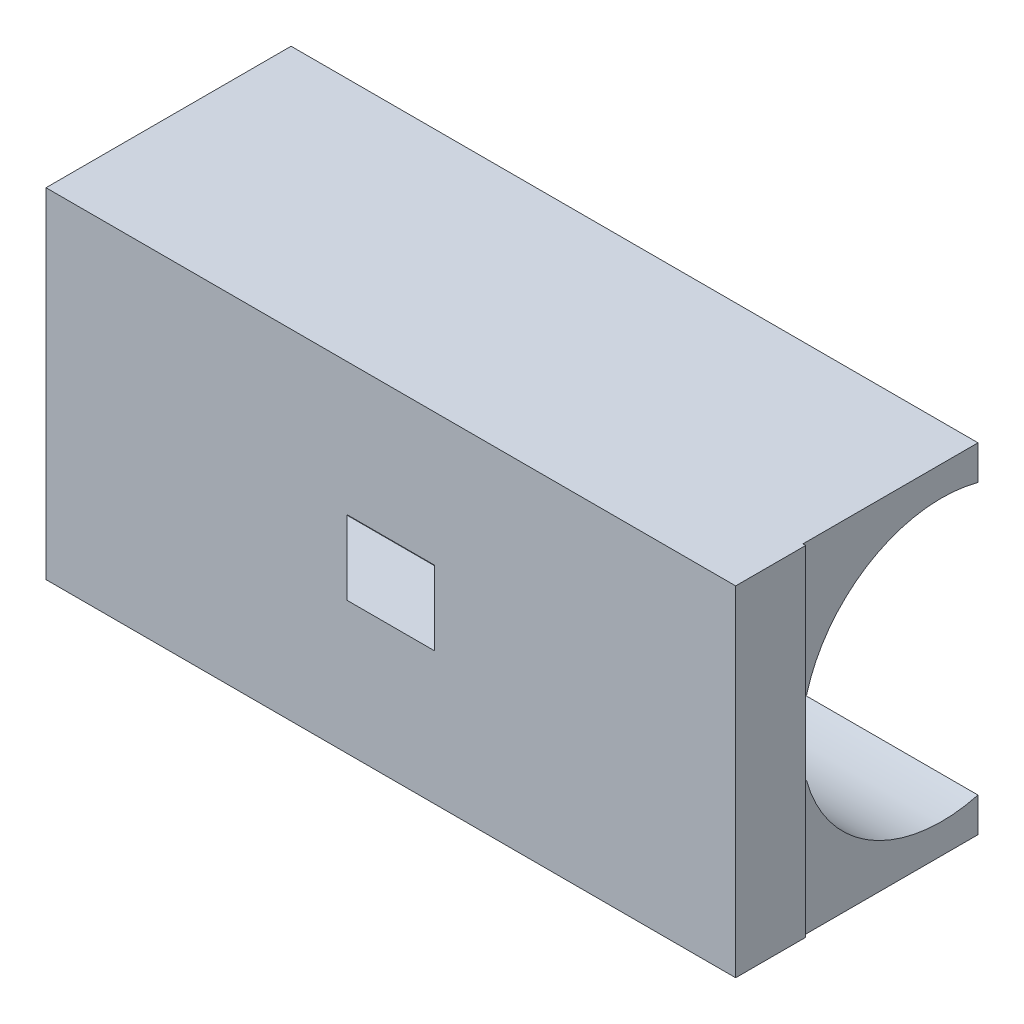
ISO-10303-21;
HEADER;
FILE_DESCRIPTION(('STEP AP214'),'2;1');
FILE_NAME('part.step','',(''),(''),'','','');
FILE_SCHEMA(('AUTOMOTIVE_DESIGN { 1 0 10303 214 1 1 1 1 }'));
ENDSEC;
DATA;
#1=APPLICATION_CONTEXT('core data for automotive mechanical design processes');
#2=APPLICATION_PROTOCOL_DEFINITION('international standard','automotive_design',2000,#1);
#3=PRODUCT_CONTEXT('',#1,'mechanical');
#4=PRODUCT('Part','Part','',(#3));
#5=PRODUCT_RELATED_PRODUCT_CATEGORY('part','',(#4));
#6=PRODUCT_DEFINITION_FORMATION('','',#4);
#7=PRODUCT_DEFINITION_CONTEXT('part definition',#1,'design');
#8=PRODUCT_DEFINITION('design','',#6,#7);
#9=PRODUCT_DEFINITION_SHAPE('','',#8);
#10=(LENGTH_UNIT() NAMED_UNIT(*) SI_UNIT(.MILLI.,.METRE.));
#11=(NAMED_UNIT(*) PLANE_ANGLE_UNIT() SI_UNIT($,.RADIAN.));
#12=(NAMED_UNIT(*) SI_UNIT($,.STERADIAN.) SOLID_ANGLE_UNIT());
#13=UNCERTAINTY_MEASURE_WITH_UNIT(LENGTH_MEASURE(1.E-05),#10,'distance_accuracy_value','');
#14=(GEOMETRIC_REPRESENTATION_CONTEXT(3) GLOBAL_UNCERTAINTY_ASSIGNED_CONTEXT((#13)) GLOBAL_UNIT_ASSIGNED_CONTEXT((#10,
#11,#12)) REPRESENTATION_CONTEXT('',''));
#15=CARTESIAN_POINT('',(0.,0.,0.));
#16=DIRECTION('',(0.,0.,1.));
#17=DIRECTION('',(1.,0.,0.));
#18=AXIS2_PLACEMENT_3D('',#15,#16,#17);
#19=CARTESIAN_POINT('',(24.9,-2.7,0.));
#20=DIRECTION('',(0.,-1.,0.));
#21=DIRECTION('',(0.,0.,-1.));
#22=AXIS2_PLACEMENT_3D('',#19,#20,#21);
#23=PLANE('',#22);
#24=DIRECTION('',(-0.707106781186546,0.,0.707106781186549));
#25=VECTOR('',#24,1.);
#26=CARTESIAN_POINT('',(21.6414213562373,-2.7,-3.25857864376272));
#27=LINE('',#26,#25);
#28=CARTESIAN_POINT('',(8.28284271247459,-2.7,10.1));
#29=VERTEX_POINT('',#28);
#30=CARTESIAN_POINT('',(3.18284271247461,-2.7,15.2));
#31=VERTEX_POINT('',#30);
#32=EDGE_CURVE('E189',#29,#31,#27,.T.);
#33=ORIENTED_EDGE('',*,*,#32,.F.);
#34=DIRECTION('',(-1.,0.,0.));
#35=VECTOR('',#34,1.);
#36=CARTESIAN_POINT('',(24.9,-2.7,10.1));
#37=LINE('',#36,#35);
#38=CARTESIAN_POINT('',(24.9,-2.7,10.1));
#39=VERTEX_POINT('',#38);
#40=EDGE_CURVE('E187',#39,#29,#37,.T.);
#41=ORIENTED_EDGE('',*,*,#40,.F.);
#42=DIRECTION('',(0.,0.,1.));
#43=VECTOR('',#42,1.);
#44=CARTESIAN_POINT('',(24.9,-2.7,0.));
#45=LINE('',#44,#43);
#46=CARTESIAN_POINT('',(24.9,-2.7,9.83615778645326));
#47=VERTEX_POINT('',#46);
#48=EDGE_CURVE('E241',#47,#39,#45,.T.);
#49=ORIENTED_EDGE('',*,*,#48,.F.);
#50=DIRECTION('',(-1.,0.,0.));
#51=VECTOR('',#50,1.);
#52=CARTESIAN_POINT('',(24.9,-2.7,9.83615778645326));
#53=LINE('',#52,#51);
#54=CARTESIAN_POINT('',(-25.1,-2.7,9.83615778645326));
#55=VERTEX_POINT('',#54);
#56=EDGE_CURVE('E264',#47,#55,#53,.T.);
#57=ORIENTED_EDGE('',*,*,#56,.T.);
#58=DIRECTION('',(0.,0.,1.));
#59=VECTOR('',#58,1.);
#60=CARTESIAN_POINT('',(-25.1,-2.7,0.));
#61=LINE('',#60,#59);
#62=CARTESIAN_POINT('',(-25.1,-2.7,10.1));
#63=VERTEX_POINT('',#62);
#64=EDGE_CURVE('E253',#55,#63,#61,.T.);
#65=ORIENTED_EDGE('',*,*,#64,.T.);
#66=DIRECTION('',(-1.,0.,0.));
#67=VECTOR('',#66,1.);
#68=CARTESIAN_POINT('',(24.9,-2.7,10.1));
#69=LINE('',#68,#67);
#70=CARTESIAN_POINT('',(-8.28284271247459,-2.7,10.1));
#71=VERTEX_POINT('',#70);
#72=EDGE_CURVE('E231',#71,#63,#69,.T.);
#73=ORIENTED_EDGE('',*,*,#72,.F.);
#74=DIRECTION('',(-0.707106781186546,0.,-0.707106781186549));
#75=VECTOR('',#74,1.);
#76=CARTESIAN_POINT('',(3.25857864376264,-2.7,21.6414213562373));
#77=LINE('',#76,#75);
#78=CARTESIAN_POINT('',(-3.1828427124746,-2.7,15.2));
#79=VERTEX_POINT('',#78);
#80=EDGE_CURVE('E234',#79,#71,#77,.T.);
#81=ORIENTED_EDGE('',*,*,#80,.F.);
#82=DIRECTION('',(-1.,0.,0.));
#83=VECTOR('',#82,1.);
#84=CARTESIAN_POINT('',(24.9,-2.7,15.2));
#85=LINE('',#84,#83);
#86=EDGE_CURVE('E154',#31,#79,#85,.T.);
#87=ORIENTED_EDGE('',*,*,#86,.F.);
#88=EDGE_LOOP('',(#33,#41,#49,#57,#65,#73,#81,#87));
#89=FACE_BOUND('',#88,.T.);
#90=ADVANCED_FACE('F33',(#89),#23,.F.);
#91=CARTESIAN_POINT('',(24.9,0.,0.));
#92=DIRECTION('',(1.,0.,0.));
#93=DIRECTION('',(0.,0.,-1.));
#94=AXIS2_PLACEMENT_3D('',#91,#92,#93);
#95=PLANE('',#94);
#96=ORIENTED_EDGE('',*,*,#48,.T.);
#97=DIRECTION('',(0.,-1.,0.));
#98=VECTOR('',#97,1.);
#99=CARTESIAN_POINT('',(24.9,0.,10.1));
#100=LINE('',#99,#98);
#101=CARTESIAN_POINT('',(24.9,-12.3524434281487,10.1));
#102=VERTEX_POINT('',#101);
#103=EDGE_CURVE('E184',#39,#102,#100,.T.);
#104=ORIENTED_EDGE('',*,*,#103,.T.);
#105=DIRECTION('',(0.,0.,1.));
#106=VECTOR('',#105,1.);
#107=CARTESIAN_POINT('',(24.9,-12.3524434281487,0.));
#108=LINE('',#107,#106);
#109=CARTESIAN_POINT('',(24.9,-12.3524434281487,-2.63995426004582));
#110=VERTEX_POINT('',#109);
#111=EDGE_CURVE('E245',#110,#102,#108,.T.);
#112=ORIENTED_EDGE('',*,*,#111,.F.);
#113=DIRECTION('',(0.,-1.,0.));
#114=VECTOR('',#113,1.);
#115=CARTESIAN_POINT('',(24.9,0.,-2.63995426004581));
#116=LINE('',#115,#114);
#117=CARTESIAN_POINT('',(24.9,-9.85244342814873,-2.63995426004581));
#118=VERTEX_POINT('',#117);
#119=EDGE_CURVE('E247',#118,#110,#116,.T.);
#120=ORIENTED_EDGE('',*,*,#119,.F.);
#121=CARTESIAN_POINT('',(24.9,0.,0.));
#122=DIRECTION('',(1.,0.,0.));
#123=DIRECTION('',(0.,0.,-1.));
#124=AXIS2_PLACEMENT_3D('',#121,#122,#123);
#125=CIRCLE('',#124,10.2000000000002);
#126=EDGE_CURVE('E238',#47,#118,#125,.T.);
#127=ORIENTED_EDGE('',*,*,#126,.F.);
#128=EDGE_LOOP('',(#96,#104,#112,#120,#127));
#129=FACE_BOUND('',#128,.T.);
#130=ADVANCED_FACE('F331',(#129),#95,.T.);
#131=CARTESIAN_POINT('',(24.9,2.7,0.));
#132=DIRECTION('',(0.,-1.,0.));
#133=DIRECTION('',(0.,0.,-1.));
#134=AXIS2_PLACEMENT_3D('',#131,#132,#133);
#135=PLANE('',#134);
#136=DIRECTION('',(-1.,0.,0.));
#137=VECTOR('',#136,1.);
#138=CARTESIAN_POINT('',(24.9,2.7,10.1));
#139=LINE('',#138,#137);
#140=CARTESIAN_POINT('',(24.9,2.7,10.1));
#141=VERTEX_POINT('',#140);
#142=CARTESIAN_POINT('',(8.28284271247459,2.7,10.1));
#143=VERTEX_POINT('',#142);
#144=EDGE_CURVE('E47',#141,#143,#139,.T.);
#145=ORIENTED_EDGE('',*,*,#144,.T.);
#146=DIRECTION('',(-0.707106781186546,0.,0.707106781186549));
#147=VECTOR('',#146,1.);
#148=CARTESIAN_POINT('',(21.6414213562373,2.7,-3.25857864376272));
#149=LINE('',#148,#147);
#150=CARTESIAN_POINT('',(3.18284271247461,2.7,15.2));
#151=VERTEX_POINT('',#150);
#152=EDGE_CURVE('E11',#143,#151,#149,.T.);
#153=ORIENTED_EDGE('',*,*,#152,.T.);
#154=DIRECTION('',(-1.,0.,0.));
#155=VECTOR('',#154,1.);
#156=CARTESIAN_POINT('',(24.9,2.7,15.2));
#157=LINE('',#156,#155);
#158=CARTESIAN_POINT('',(-3.18284271247461,2.7,15.2));
#159=VERTEX_POINT('',#158);
#160=EDGE_CURVE('E201',#151,#159,#157,.T.);
#161=ORIENTED_EDGE('',*,*,#160,.T.);
#162=DIRECTION('',(0.707106781186546,0.,0.707106781186549));
#163=VECTOR('',#162,1.);
#164=CARTESIAN_POINT('',(-3.18284271247461,2.7,15.2));
#165=LINE('',#164,#163);
#166=CARTESIAN_POINT('',(-8.28284271247459,2.7,10.1));
#167=VERTEX_POINT('',#166);
#168=EDGE_CURVE('E216',#167,#159,#165,.T.);
#169=ORIENTED_EDGE('',*,*,#168,.F.);
#170=DIRECTION('',(1.,0.,0.));
#171=VECTOR('',#170,1.);
#172=CARTESIAN_POINT('',(-25.1,2.7,10.1));
#173=LINE('',#172,#171);
#174=CARTESIAN_POINT('',(-25.1,2.7,10.1));
#175=VERTEX_POINT('',#174);
#176=EDGE_CURVE('E266',#175,#167,#173,.T.);
#177=ORIENTED_EDGE('',*,*,#176,.F.);
#178=DIRECTION('',(0.,0.,1.));
#179=VECTOR('',#178,1.);
#180=CARTESIAN_POINT('',(-25.1,2.7,0.));
#181=LINE('',#180,#179);
#182=CARTESIAN_POINT('',(-25.1,2.7,9.83615778645326));
#183=VERTEX_POINT('',#182);
#184=EDGE_CURVE('E191',#183,#175,#181,.T.);
#185=ORIENTED_EDGE('',*,*,#184,.F.);
#186=DIRECTION('',(-1.,0.,0.));
#187=VECTOR('',#186,1.);
#188=CARTESIAN_POINT('',(24.9,2.7,9.83615778645326));
#189=LINE('',#188,#187);
#190=CARTESIAN_POINT('',(24.9,2.7,9.83615778645326));
#191=VERTEX_POINT('',#190);
#192=EDGE_CURVE('E214',#191,#183,#189,.T.);
#193=ORIENTED_EDGE('',*,*,#192,.F.);
#194=DIRECTION('',(0.,0.,1.));
#195=VECTOR('',#194,1.);
#196=CARTESIAN_POINT('',(24.9,2.7,0.));
#197=LINE('',#196,#195);
#198=EDGE_CURVE('E192',#191,#141,#197,.T.);
#199=ORIENTED_EDGE('',*,*,#198,.T.);
#200=EDGE_LOOP('',(#145,#153,#161,#169,#177,#185,#193,#199));
#201=FACE_BOUND('',#200,.T.);
#202=ADVANCED_FACE('F275',(#201),#135,.T.);
#203=CARTESIAN_POINT('',(24.9,0.,0.));
#204=DIRECTION('',(1.,0.,0.));
#205=DIRECTION('',(0.,0.,-1.));
#206=AXIS2_PLACEMENT_3D('',#203,#204,#205);
#207=PLANE('',#206);
#208=DIRECTION('',(0.,0.,1.));
#209=VECTOR('',#208,1.);
#210=CARTESIAN_POINT('',(24.9,12.3524434281487,0.));
#211=LINE('',#210,#209);
#212=CARTESIAN_POINT('',(24.9,12.3524434281487,-2.63995426004582));
#213=VERTEX_POINT('',#212);
#214=CARTESIAN_POINT('',(24.9,12.3524434281487,10.1));
#215=VERTEX_POINT('',#214);
#216=EDGE_CURVE('E199',#213,#215,#211,.T.);
#217=ORIENTED_EDGE('',*,*,#216,.T.);
#218=DIRECTION('',(0.,-1.,0.));
#219=VECTOR('',#218,1.);
#220=CARTESIAN_POINT('',(24.9,0.,10.1));
#221=LINE('',#220,#219);
#222=EDGE_CURVE('E41',#215,#141,#221,.T.);
#223=ORIENTED_EDGE('',*,*,#222,.T.);
#224=ORIENTED_EDGE('',*,*,#198,.F.);
#225=CARTESIAN_POINT('',(24.9,0.,0.));
#226=DIRECTION('',(1.,0.,0.));
#227=DIRECTION('',(0.,0.,-1.));
#228=AXIS2_PLACEMENT_3D('',#225,#226,#227);
#229=CIRCLE('',#228,10.2000000000002);
#230=CARTESIAN_POINT('',(24.9,9.85244342814873,-2.63995426004581));
#231=VERTEX_POINT('',#230);
#232=EDGE_CURVE('E194',#191,#231,#229,.F.);
#233=ORIENTED_EDGE('',*,*,#232,.T.);
#234=DIRECTION('',(0.,1.,0.));
#235=VECTOR('',#234,1.);
#236=CARTESIAN_POINT('',(24.9,0.,-2.63995426004581));
#237=LINE('',#236,#235);
#238=EDGE_CURVE('E197',#231,#213,#237,.T.);
#239=ORIENTED_EDGE('',*,*,#238,.T.);
#240=EDGE_LOOP('',(#217,#223,#224,#233,#239));
#241=FACE_BOUND('',#240,.T.);
#242=ADVANCED_FACE('F271',(#241),#207,.T.);
#243=CARTESIAN_POINT('',(24.9,0.,0.));
#244=DIRECTION('',(-1.,0.,0.));
#245=DIRECTION('',(0.,0.,1.));
#246=AXIS2_PLACEMENT_3D('',#243,#244,#245);
#247=CYLINDRICAL_SURFACE('',#246,10.2000000000002);
#248=CARTESIAN_POINT('',(-25.1,0.,0.));
#249=DIRECTION('',(1.,0.,0.));
#250=DIRECTION('',(0.,0.,-1.));
#251=AXIS2_PLACEMENT_3D('',#248,#249,#250);
#252=CIRCLE('',#251,10.2000000000002);
#253=CARTESIAN_POINT('',(-25.1,-9.85244342814873,-2.63995426004582));
#254=VERTEX_POINT('',#253);
#255=EDGE_CURVE('E237',#55,#254,#252,.T.);
#256=ORIENTED_EDGE('',*,*,#255,.F.);
#257=ORIENTED_EDGE('',*,*,#56,.F.);
#258=ORIENTED_EDGE('',*,*,#126,.T.);
#259=DIRECTION('',(-1.,0.,0.));
#260=VECTOR('',#259,1.);
#261=CARTESIAN_POINT('',(24.9,-9.85244342814873,-2.63995426004581));
#262=LINE('',#261,#260);
#263=EDGE_CURVE('E250',#118,#254,#262,.T.);
#264=ORIENTED_EDGE('',*,*,#263,.T.);
#265=EDGE_LOOP('',(#256,#257,#258,#264));
#266=FACE_BOUND('',#265,.T.);
#267=ADVANCED_FACE('F35',(#266),#247,.F.);
#268=CARTESIAN_POINT('',(24.9,0.,15.2));
#269=DIRECTION('',(0.,0.,1.));
#270=DIRECTION('',(0.,-1.,0.));
#271=AXIS2_PLACEMENT_3D('',#268,#269,#270);
#272=PLANE('',#271);
#273=DIRECTION('',(0.,-1.,0.));
#274=VECTOR('',#273,1.);
#275=CARTESIAN_POINT('',(3.18284271247461,12.3524434281487,15.2));
#276=LINE('',#275,#274);
#277=EDGE_CURVE('E164',#151,#31,#276,.T.);
#278=ORIENTED_EDGE('',*,*,#277,.T.);
#279=ORIENTED_EDGE('',*,*,#86,.T.);
#280=DIRECTION('',(0.,-1.,0.));
#281=VECTOR('',#280,1.);
#282=CARTESIAN_POINT('',(-3.18284271247461,12.3524434281487,15.2));
#283=LINE('',#282,#281);
#284=EDGE_CURVE('E228',#159,#79,#283,.T.);
#285=ORIENTED_EDGE('',*,*,#284,.F.);
#286=ORIENTED_EDGE('',*,*,#160,.F.);
#287=EDGE_LOOP('',(#278,#279,#285,#286));
#288=FACE_BOUND('',#287,.T.);
#289=DIRECTION('',(0.,-1.,0.));
#290=VECTOR('',#289,1.);
#291=CARTESIAN_POINT('',(25.1,12.3524434281487,15.2));
#292=LINE('',#291,#290);
#293=CARTESIAN_POINT('',(25.1,12.3524434281487,15.2));
#294=VERTEX_POINT('',#293);
#295=CARTESIAN_POINT('',(25.1,-12.3524434281487,15.2));
#296=VERTEX_POINT('',#295);
#297=EDGE_CURVE('E147',#294,#296,#292,.T.);
#298=ORIENTED_EDGE('',*,*,#297,.F.);
#299=DIRECTION('',(1.,0.,0.));
#300=VECTOR('',#299,1.);
#301=CARTESIAN_POINT('',(-25.1,12.3524434281487,15.2));
#302=LINE('',#301,#300);
#303=CARTESIAN_POINT('',(-25.1,12.3524434281487,15.2));
#304=VERTEX_POINT('',#303);
#305=EDGE_CURVE('E222',#304,#294,#302,.T.);
#306=ORIENTED_EDGE('',*,*,#305,.F.);
#307=DIRECTION('',(0.,1.,0.));
#308=VECTOR('',#307,1.);
#309=CARTESIAN_POINT('',(-25.1,0.,15.2));
#310=LINE('',#309,#308);
#311=CARTESIAN_POINT('',(-25.1,-12.3524434281487,15.2));
#312=VERTEX_POINT('',#311);
#313=EDGE_CURVE('E149',#312,#304,#310,.T.);
#314=ORIENTED_EDGE('',*,*,#313,.F.);
#315=DIRECTION('',(-1.,0.,0.));
#316=VECTOR('',#315,1.);
#317=CARTESIAN_POINT('',(24.9,-12.3524434281487,15.2));
#318=LINE('',#317,#316);
#319=EDGE_CURVE('E143',#296,#312,#318,.T.);
#320=ORIENTED_EDGE('',*,*,#319,.F.);
#321=EDGE_LOOP('',(#298,#306,#314,#320));
#322=FACE_BOUND('',#321,.T.);
#323=ADVANCED_FACE('F145',(#288,#322),#272,.T.);
#324=CARTESIAN_POINT('',(24.9,-12.3524434281487,0.));
#325=DIRECTION('',(0.,-1.,0.));
#326=DIRECTION('',(0.,0.,-1.));
#327=AXIS2_PLACEMENT_3D('',#324,#325,#326);
#328=PLANE('',#327);
#329=ORIENTED_EDGE('',*,*,#319,.T.);
#330=DIRECTION('',(0.,0.,1.));
#331=VECTOR('',#330,1.);
#332=CARTESIAN_POINT('',(-25.1,-12.3524434281487,0.));
#333=LINE('',#332,#331);
#334=CARTESIAN_POINT('',(-25.1,-12.3524434281487,-2.63995426004582));
#335=VERTEX_POINT('',#334);
#336=EDGE_CURVE('E257',#335,#312,#333,.T.);
#337=ORIENTED_EDGE('',*,*,#336,.F.);
#338=DIRECTION('',(-1.,0.,0.));
#339=VECTOR('',#338,1.);
#340=CARTESIAN_POINT('',(24.9,-12.3524434281487,-2.63995426004582));
#341=LINE('',#340,#339);
#342=EDGE_CURVE('E155',#110,#335,#341,.T.);
#343=ORIENTED_EDGE('',*,*,#342,.F.);
#344=ORIENTED_EDGE('',*,*,#111,.T.);
#345=DIRECTION('',(-1.,0.,0.));
#346=VECTOR('',#345,1.);
#347=CARTESIAN_POINT('',(8.28284271247459,-12.3524434281487,10.1));
#348=LINE('',#347,#346);
#349=CARTESIAN_POINT('',(25.1,-12.3524434281487,10.1));
#350=VERTEX_POINT('',#349);
#351=EDGE_CURVE('E169',#350,#102,#348,.T.);
#352=ORIENTED_EDGE('',*,*,#351,.F.);
#353=DIRECTION('',(0.,0.,-1.));
#354=VECTOR('',#353,1.);
#355=CARTESIAN_POINT('',(25.1,-12.3524434281487,10.1));
#356=LINE('',#355,#354);
#357=EDGE_CURVE('E161',#296,#350,#356,.T.);
#358=ORIENTED_EDGE('',*,*,#357,.F.);
#359=EDGE_LOOP('',(#329,#337,#343,#344,#352,#358));
#360=FACE_BOUND('',#359,.T.);
#361=ADVANCED_FACE('F167',(#360),#328,.T.);
#362=CARTESIAN_POINT('',(24.9,0.,-2.63995426004581));
#363=DIRECTION('',(0.,0.,-1.));
#364=DIRECTION('',(0.,1.,0.));
#365=AXIS2_PLACEMENT_3D('',#362,#363,#364);
#366=PLANE('',#365);
#367=DIRECTION('',(0.,-1.,0.));
#368=VECTOR('',#367,1.);
#369=CARTESIAN_POINT('',(-25.1,0.,-2.63995426004581));
#370=LINE('',#369,#368);
#371=EDGE_CURVE('E242',#254,#335,#370,.T.);
#372=ORIENTED_EDGE('',*,*,#371,.F.);
#373=ORIENTED_EDGE('',*,*,#263,.F.);
#374=ORIENTED_EDGE('',*,*,#119,.T.);
#375=ORIENTED_EDGE('',*,*,#342,.T.);
#376=EDGE_LOOP('',(#372,#373,#374,#375));
#377=FACE_BOUND('',#376,.T.);
#378=ADVANCED_FACE('F309',(#377),#366,.T.);
#379=CARTESIAN_POINT('',(-25.1,0.,0.));
#380=DIRECTION('',(1.,0.,0.));
#381=DIRECTION('',(0.,0.,-1.));
#382=AXIS2_PLACEMENT_3D('',#379,#380,#381);
#383=PLANE('',#382);
#384=ORIENTED_EDGE('',*,*,#313,.T.);
#385=DIRECTION('',(0.,0.,1.));
#386=VECTOR('',#385,1.);
#387=CARTESIAN_POINT('',(-25.1,12.3524434281487,10.1));
#388=LINE('',#387,#386);
#389=CARTESIAN_POINT('',(-25.1,12.3524434281487,-2.63995426004582));
#390=VERTEX_POINT('',#389);
#391=EDGE_CURVE('E219',#390,#304,#388,.T.);
#392=ORIENTED_EDGE('',*,*,#391,.F.);
#393=DIRECTION('',(0.,1.,0.));
#394=VECTOR('',#393,1.);
#395=CARTESIAN_POINT('',(-25.1,0.,-2.63995426004581));
#396=LINE('',#395,#394);
#397=CARTESIAN_POINT('',(-25.1,9.85244342814873,-2.63995426004582));
#398=VERTEX_POINT('',#397);
#399=EDGE_CURVE('E195',#398,#390,#396,.T.);
#400=ORIENTED_EDGE('',*,*,#399,.F.);
#401=CARTESIAN_POINT('',(-25.1,0.,0.));
#402=DIRECTION('',(1.,0.,0.));
#403=DIRECTION('',(0.,0.,-1.));
#404=AXIS2_PLACEMENT_3D('',#401,#402,#403);
#405=CIRCLE('',#404,10.2000000000002);
#406=EDGE_CURVE('E203',#183,#398,#405,.F.);
#407=ORIENTED_EDGE('',*,*,#406,.F.);
#408=ORIENTED_EDGE('',*,*,#184,.T.);
#409=DIRECTION('',(0.,-1.,0.));
#410=VECTOR('',#409,1.);
#411=CARTESIAN_POINT('',(-25.1,12.3524434281487,10.1));
#412=LINE('',#411,#410);
#413=EDGE_CURVE('E224',#175,#63,#412,.T.);
#414=ORIENTED_EDGE('',*,*,#413,.T.);
#415=ORIENTED_EDGE('',*,*,#64,.F.);
#416=ORIENTED_EDGE('',*,*,#255,.T.);
#417=ORIENTED_EDGE('',*,*,#371,.T.);
#418=ORIENTED_EDGE('',*,*,#336,.T.);
#419=EDGE_LOOP('',(#384,#392,#400,#407,#408,#414,#415,#416,#417,#418));
#420=FACE_BOUND('',#419,.T.);
#421=ADVANCED_FACE('F301',(#420),#383,.F.);
#422=CARTESIAN_POINT('',(-3.18284271247461,12.3524434281487,15.2));
#423=DIRECTION('',(-0.707106781186549,0.,0.707106781186546));
#424=DIRECTION('',(0.707106781186546,0.,0.707106781186549));
#425=AXIS2_PLACEMENT_3D('',#422,#423,#424);
#426=PLANE('',#425);
#427=DIRECTION('',(0.,-1.,0.));
#428=VECTOR('',#427,1.);
#429=CARTESIAN_POINT('',(-8.28284271247459,12.3524434281487,10.1));
#430=LINE('',#429,#428);
#431=EDGE_CURVE('E226',#167,#71,#430,.T.);
#432=ORIENTED_EDGE('',*,*,#431,.F.);
#433=ORIENTED_EDGE('',*,*,#168,.T.);
#434=ORIENTED_EDGE('',*,*,#284,.T.);
#435=ORIENTED_EDGE('',*,*,#80,.T.);
#436=EDGE_LOOP('',(#432,#433,#434,#435));
#437=FACE_BOUND('',#436,.T.);
#438=ADVANCED_FACE('F294',(#437),#426,.F.);
#439=CARTESIAN_POINT('',(-25.1,12.3524434281487,10.1));
#440=DIRECTION('',(0.,0.,1.));
#441=DIRECTION('',(1.,0.,0.));
#442=AXIS2_PLACEMENT_3D('',#439,#440,#441);
#443=PLANE('',#442);
#444=ORIENTED_EDGE('',*,*,#413,.F.);
#445=ORIENTED_EDGE('',*,*,#176,.T.);
#446=ORIENTED_EDGE('',*,*,#431,.T.);
#447=ORIENTED_EDGE('',*,*,#72,.T.);
#448=EDGE_LOOP('',(#444,#445,#446,#447));
#449=FACE_BOUND('',#448,.T.);
#450=ADVANCED_FACE('F298',(#449),#443,.F.);
#451=CARTESIAN_POINT('',(0.,12.3524434281487,0.));
#452=DIRECTION('',(0.,1.,0.));
#453=DIRECTION('',(0.,0.,1.));
#454=AXIS2_PLACEMENT_3D('',#451,#452,#453);
#455=PLANE('',#454);
#456=ORIENTED_EDGE('',*,*,#305,.T.);
#457=DIRECTION('',(0.,0.,-1.));
#458=VECTOR('',#457,1.);
#459=CARTESIAN_POINT('',(25.1,12.3524434281487,10.1));
#460=LINE('',#459,#458);
#461=CARTESIAN_POINT('',(25.1,12.3524434281487,10.1));
#462=VERTEX_POINT('',#461);
#463=EDGE_CURVE('E163',#294,#462,#460,.T.);
#464=ORIENTED_EDGE('',*,*,#463,.T.);
#465=DIRECTION('',(-1.,0.,0.));
#466=VECTOR('',#465,1.);
#467=CARTESIAN_POINT('',(8.28284271247459,12.3524434281487,10.1));
#468=LINE('',#467,#466);
#469=EDGE_CURVE('E174',#462,#215,#468,.T.);
#470=ORIENTED_EDGE('',*,*,#469,.T.);
#471=ORIENTED_EDGE('',*,*,#216,.F.);
#472=DIRECTION('',(-1.,0.,0.));
#473=VECTOR('',#472,1.);
#474=CARTESIAN_POINT('',(24.9,12.3524434281487,-2.63995426004582));
#475=LINE('',#474,#473);
#476=EDGE_CURVE('E208',#213,#390,#475,.T.);
#477=ORIENTED_EDGE('',*,*,#476,.T.);
#478=ORIENTED_EDGE('',*,*,#391,.T.);
#479=EDGE_LOOP('',(#456,#464,#470,#471,#477,#478));
#480=FACE_BOUND('',#479,.T.);
#481=ADVANCED_FACE('F313',(#480),#455,.T.);
#482=CARTESIAN_POINT('',(24.9,0.,0.));
#483=DIRECTION('',(-1.,0.,0.));
#484=DIRECTION('',(0.,0.,1.));
#485=AXIS2_PLACEMENT_3D('',#482,#483,#484);
#486=CYLINDRICAL_SURFACE('',#485,10.2000000000002);
#487=ORIENTED_EDGE('',*,*,#406,.T.);
#488=DIRECTION('',(-1.,0.,0.));
#489=VECTOR('',#488,1.);
#490=CARTESIAN_POINT('',(24.9,9.85244342814873,-2.63995426004581));
#491=LINE('',#490,#489);
#492=EDGE_CURVE('E211',#231,#398,#491,.T.);
#493=ORIENTED_EDGE('',*,*,#492,.F.);
#494=ORIENTED_EDGE('',*,*,#232,.F.);
#495=ORIENTED_EDGE('',*,*,#192,.T.);
#496=EDGE_LOOP('',(#487,#493,#494,#495));
#497=FACE_BOUND('',#496,.T.);
#498=ADVANCED_FACE('F320',(#497),#486,.F.);
#499=CARTESIAN_POINT('',(24.9,0.,-2.63995426004581));
#500=DIRECTION('',(0.,0.,1.));
#501=DIRECTION('',(0.,-1.,0.));
#502=AXIS2_PLACEMENT_3D('',#499,#500,#501);
#503=PLANE('',#502);
#504=ORIENTED_EDGE('',*,*,#399,.T.);
#505=ORIENTED_EDGE('',*,*,#476,.F.);
#506=ORIENTED_EDGE('',*,*,#238,.F.);
#507=ORIENTED_EDGE('',*,*,#492,.T.);
#508=EDGE_LOOP('',(#504,#505,#506,#507));
#509=FACE_BOUND('',#508,.T.);
#510=ADVANCED_FACE('F317',(#509),#503,.F.);
#511=CARTESIAN_POINT('',(3.18284271247461,12.3524434281487,15.2));
#512=DIRECTION('',(0.707106781186549,0.,0.707106781186546));
#513=DIRECTION('',(0.707106781186546,0.,-0.707106781186549));
#514=AXIS2_PLACEMENT_3D('',#511,#512,#513);
#515=PLANE('',#514);
#516=DIRECTION('',(0.,-1.,0.));
#517=VECTOR('',#516,1.);
#518=CARTESIAN_POINT('',(8.28284271247459,12.3524434281487,10.1));
#519=LINE('',#518,#517);
#520=EDGE_CURVE('E177',#143,#29,#519,.T.);
#521=ORIENTED_EDGE('',*,*,#520,.T.);
#522=ORIENTED_EDGE('',*,*,#32,.T.);
#523=ORIENTED_EDGE('',*,*,#277,.F.);
#524=ORIENTED_EDGE('',*,*,#152,.F.);
#525=EDGE_LOOP('',(#521,#522,#523,#524));
#526=FACE_BOUND('',#525,.T.);
#527=ADVANCED_FACE('F283',(#526),#515,.F.);
#528=CARTESIAN_POINT('',(8.28284271247459,12.3524434281487,10.1));
#529=DIRECTION('',(0.,0.,1.));
#530=DIRECTION('',(1.,0.,0.));
#531=AXIS2_PLACEMENT_3D('',#528,#529,#530);
#532=PLANE('',#531);
#533=ORIENTED_EDGE('',*,*,#103,.F.);
#534=ORIENTED_EDGE('',*,*,#40,.T.);
#535=ORIENTED_EDGE('',*,*,#520,.F.);
#536=ORIENTED_EDGE('',*,*,#144,.F.);
#537=ORIENTED_EDGE('',*,*,#222,.F.);
#538=ORIENTED_EDGE('',*,*,#469,.F.);
#539=DIRECTION('',(0.,-1.,0.));
#540=VECTOR('',#539,1.);
#541=CARTESIAN_POINT('',(25.1,12.3524434281487,10.1));
#542=LINE('',#541,#540);
#543=EDGE_CURVE('E165',#462,#350,#542,.T.);
#544=ORIENTED_EDGE('',*,*,#543,.T.);
#545=ORIENTED_EDGE('',*,*,#351,.T.);
#546=EDGE_LOOP('',(#533,#534,#535,#536,#537,#538,#544,#545));
#547=FACE_BOUND('',#546,.T.);
#548=ADVANCED_FACE('F279',(#547),#532,.F.);
#549=CARTESIAN_POINT('',(25.1,12.3524434281487,10.1));
#550=DIRECTION('',(-1.,0.,0.));
#551=DIRECTION('',(0.,0.,1.));
#552=AXIS2_PLACEMENT_3D('',#549,#550,#551);
#553=PLANE('',#552);
#554=ORIENTED_EDGE('',*,*,#297,.T.);
#555=ORIENTED_EDGE('',*,*,#357,.T.);
#556=ORIENTED_EDGE('',*,*,#543,.F.);
#557=ORIENTED_EDGE('',*,*,#463,.F.);
#558=EDGE_LOOP('',(#554,#555,#556,#557));
#559=FACE_BOUND('',#558,.T.);
#560=ADVANCED_FACE('F159',(#559),#553,.F.);
#561=CLOSED_SHELL('',(#90,#130,#202,#242,#267,#323,#361,#378,#421,#438,#450,#481,#498,#510,#527,
#548,#560));
#562=MANIFOLD_SOLID_BREP('B2',#561);
#563=ADVANCED_BREP_SHAPE_REPRESENTATION('',(#18,#562),#14);
#564=SHAPE_DEFINITION_REPRESENTATION(#9,#563);
ENDSEC;
END-ISO-10303-21;
